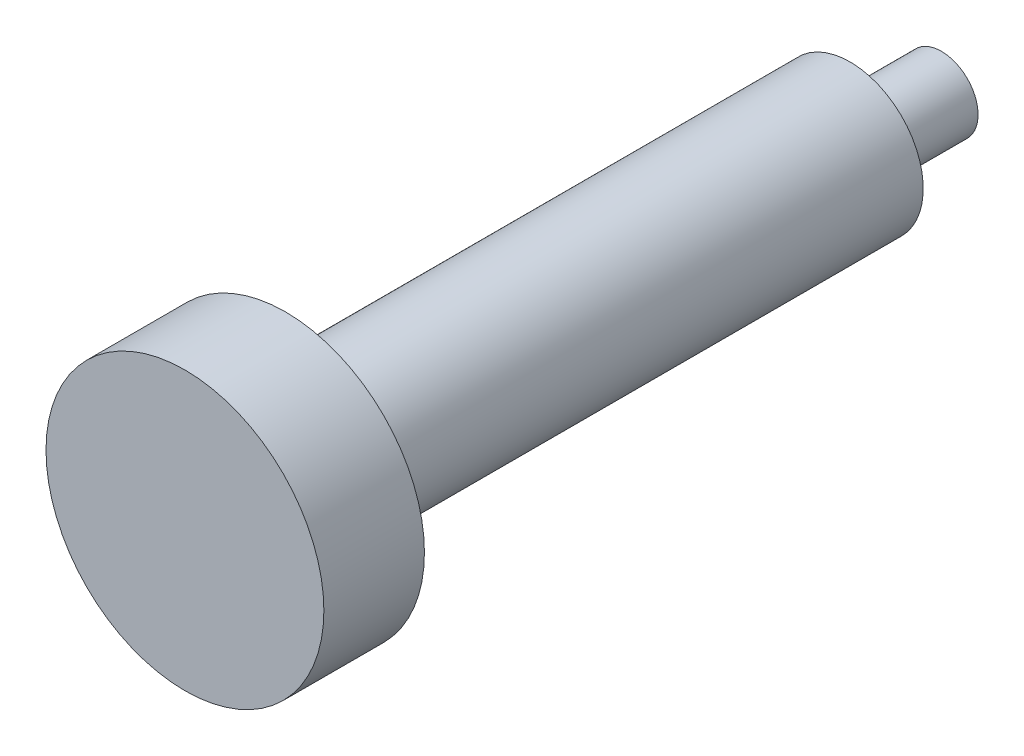
ISO-10303-21;
HEADER;
FILE_DESCRIPTION(('STEP AP214'),'2;1');
FILE_NAME('part.step','',(''),(''),'','','');
FILE_SCHEMA(('AUTOMOTIVE_DESIGN { 1 0 10303 214 1 1 1 1 }'));
ENDSEC;
DATA;
#1=APPLICATION_CONTEXT('core data for automotive mechanical design processes');
#2=APPLICATION_PROTOCOL_DEFINITION('international standard','automotive_design',2000,#1);
#3=PRODUCT_CONTEXT('',#1,'mechanical');
#4=PRODUCT('Part','Part','',(#3));
#5=PRODUCT_RELATED_PRODUCT_CATEGORY('part','',(#4));
#6=PRODUCT_DEFINITION_FORMATION('','',#4);
#7=PRODUCT_DEFINITION_CONTEXT('part definition',#1,'design');
#8=PRODUCT_DEFINITION('design','',#6,#7);
#9=PRODUCT_DEFINITION_SHAPE('','',#8);
#10=(LENGTH_UNIT() NAMED_UNIT(*) SI_UNIT(.MILLI.,.METRE.));
#11=(NAMED_UNIT(*) PLANE_ANGLE_UNIT() SI_UNIT($,.RADIAN.));
#12=(NAMED_UNIT(*) SI_UNIT($,.STERADIAN.) SOLID_ANGLE_UNIT());
#13=UNCERTAINTY_MEASURE_WITH_UNIT(LENGTH_MEASURE(1.E-05),#10,'distance_accuracy_value','');
#14=(GEOMETRIC_REPRESENTATION_CONTEXT(3) GLOBAL_UNCERTAINTY_ASSIGNED_CONTEXT((#13)) GLOBAL_UNIT_ASSIGNED_CONTEXT((#10,
#11,#12)) REPRESENTATION_CONTEXT('',''));
#15=CARTESIAN_POINT('',(0.,0.,0.));
#16=DIRECTION('',(0.,0.,1.));
#17=DIRECTION('',(1.,0.,0.));
#18=AXIS2_PLACEMENT_3D('',#15,#16,#17);
#19=CARTESIAN_POINT('',(0.,0.,-20.));
#20=DIRECTION('',(0.,0.,1.));
#21=DIRECTION('',(1.,0.,0.));
#22=AXIS2_PLACEMENT_3D('',#19,#20,#21);
#23=PLANE('',#22);
#24=CARTESIAN_POINT('',(0.,0.,-20.));
#25=DIRECTION('',(0.,0.,-1.));
#26=DIRECTION('',(-1.,0.,0.));
#27=AXIS2_PLACEMENT_3D('',#24,#25,#26);
#28=CIRCLE('',#27,8.);
#29=CARTESIAN_POINT('',(-8.,0.,-20.));
#30=VERTEX_POINT('',#29);
#31=EDGE_CURVE('E10',#30,#30,#28,.T.);
#32=ORIENTED_EDGE('',*,*,#31,.T.);
#33=EDGE_LOOP('',(#32));
#34=FACE_BOUND('',#33,.T.);
#35=ADVANCED_FACE('F37',(#34),#23,.F.);
#36=CARTESIAN_POINT('',(0.,0.,-20.));
#37=DIRECTION('',(0.,0.,-1.));
#38=DIRECTION('',(-1.,0.,0.));
#39=AXIS2_PLACEMENT_3D('',#36,#37,#38);
#40=CYLINDRICAL_SURFACE('',#39,8.);
#41=ORIENTED_EDGE('',*,*,#31,.F.);
#42=EDGE_LOOP('',(#41));
#43=FACE_BOUND('',#42,.T.);
#44=CARTESIAN_POINT('',(0.,0.,0.));
#45=DIRECTION('',(0.,0.,-1.));
#46=DIRECTION('',(-1.,0.,0.));
#47=AXIS2_PLACEMENT_3D('',#44,#45,#46);
#48=CIRCLE('',#47,8.);
#49=CARTESIAN_POINT('',(-8.,0.,0.));
#50=VERTEX_POINT('',#49);
#51=EDGE_CURVE('E43',#50,#50,#48,.T.);
#52=ORIENTED_EDGE('',*,*,#51,.T.);
#53=EDGE_LOOP('',(#52));
#54=FACE_BOUND('',#53,.T.);
#55=ADVANCED_FACE('F75',(#43,#54),#40,.T.);
#56=CARTESIAN_POINT('',(8.,0.,0.));
#57=DIRECTION('',(0.,0.,1.));
#58=DIRECTION('',(1.,0.,0.));
#59=AXIS2_PLACEMENT_3D('',#56,#57,#58);
#60=PLANE('',#59);
#61=ORIENTED_EDGE('',*,*,#51,.F.);
#62=EDGE_LOOP('',(#61));
#63=FACE_BOUND('',#62,.T.);
#64=CARTESIAN_POINT('',(0.,0.,0.));
#65=DIRECTION('',(0.,0.,-1.));
#66=DIRECTION('',(-1.,0.,0.));
#67=AXIS2_PLACEMENT_3D('',#64,#65,#66);
#68=CIRCLE('',#67,16.);
#69=CARTESIAN_POINT('',(-16.,0.,0.));
#70=VERTEX_POINT('',#69);
#71=EDGE_CURVE('E47',#70,#70,#68,.T.);
#72=ORIENTED_EDGE('',*,*,#71,.T.);
#73=EDGE_LOOP('',(#72));
#74=FACE_BOUND('',#73,.T.);
#75=ADVANCED_FACE('F79',(#63,#74),#60,.F.);
#76=CARTESIAN_POINT('',(0.,0.,-20.));
#77=DIRECTION('',(0.,0.,-1.));
#78=DIRECTION('',(-1.,0.,0.));
#79=AXIS2_PLACEMENT_3D('',#76,#77,#78);
#80=CYLINDRICAL_SURFACE('',#79,16.);
#81=ORIENTED_EDGE('',*,*,#71,.F.);
#82=EDGE_LOOP('',(#81));
#83=FACE_BOUND('',#82,.T.);
#84=CARTESIAN_POINT('',(0.,0.,123.535));
#85=DIRECTION('',(0.,0.,-1.));
#86=DIRECTION('',(-1.,0.,0.));
#87=AXIS2_PLACEMENT_3D('',#84,#85,#86);
#88=CIRCLE('',#87,16.);
#89=CARTESIAN_POINT('',(-16.,0.,123.535));
#90=VERTEX_POINT('',#89);
#91=EDGE_CURVE('E51',#90,#90,#88,.T.);
#92=ORIENTED_EDGE('',*,*,#91,.T.);
#93=EDGE_LOOP('',(#92));
#94=FACE_BOUND('',#93,.T.);
#95=ADVANCED_FACE('F84',(#83,#94),#80,.T.);
#96=CARTESIAN_POINT('',(16.,0.,123.535));
#97=DIRECTION('',(0.,0.,1.));
#98=DIRECTION('',(1.,0.,0.));
#99=AXIS2_PLACEMENT_3D('',#96,#97,#98);
#100=PLANE('',#99);
#101=ORIENTED_EDGE('',*,*,#91,.F.);
#102=EDGE_LOOP('',(#101));
#103=FACE_BOUND('',#102,.T.);
#104=CARTESIAN_POINT('',(0.,0.,123.535));
#105=DIRECTION('',(0.,0.,-1.));
#106=DIRECTION('',(-1.,0.,0.));
#107=AXIS2_PLACEMENT_3D('',#104,#105,#106);
#108=CIRCLE('',#107,30.4);
#109=CARTESIAN_POINT('',(-30.4,0.,123.535));
#110=VERTEX_POINT('',#109);
#111=EDGE_CURVE('E56',#110,#110,#108,.T.);
#112=ORIENTED_EDGE('',*,*,#111,.T.);
#113=EDGE_LOOP('',(#112));
#114=FACE_BOUND('',#113,.T.);
#115=ADVANCED_FACE('F71',(#103,#114),#100,.F.);
#116=CARTESIAN_POINT('',(0.,0.,-20.));
#117=DIRECTION('',(0.,0.,-1.));
#118=DIRECTION('',(-1.,0.,0.));
#119=AXIS2_PLACEMENT_3D('',#116,#117,#118);
#120=CYLINDRICAL_SURFACE('',#119,30.4);
#121=ORIENTED_EDGE('',*,*,#111,.F.);
#122=EDGE_LOOP('',(#121));
#123=FACE_BOUND('',#122,.T.);
#124=CARTESIAN_POINT('',(0.,0.,145.535));
#125=DIRECTION('',(0.,0.,-1.));
#126=DIRECTION('',(-1.,0.,0.));
#127=AXIS2_PLACEMENT_3D('',#124,#125,#126);
#128=CIRCLE('',#127,30.4);
#129=CARTESIAN_POINT('',(-30.4,0.,145.535));
#130=VERTEX_POINT('',#129);
#131=EDGE_CURVE('E59',#130,#130,#128,.T.);
#132=ORIENTED_EDGE('',*,*,#131,.T.);
#133=EDGE_LOOP('',(#132));
#134=FACE_BOUND('',#133,.T.);
#135=ADVANCED_FACE('F63',(#123,#134),#120,.T.);
#136=CARTESIAN_POINT('',(30.4,0.,145.535));
#137=DIRECTION('',(0.,0.,-1.));
#138=DIRECTION('',(-1.,0.,0.));
#139=AXIS2_PLACEMENT_3D('',#136,#137,#138);
#140=PLANE('',#139);
#141=ORIENTED_EDGE('',*,*,#131,.F.);
#142=EDGE_LOOP('',(#141));
#143=FACE_BOUND('',#142,.T.);
#144=ADVANCED_FACE('F65',(#143),#140,.F.);
#145=CLOSED_SHELL('',(#35,#55,#75,#95,#115,#135,#144));
#146=MANIFOLD_SOLID_BREP('B2',#145);
#147=ADVANCED_BREP_SHAPE_REPRESENTATION('',(#18,#146),#14);
#148=SHAPE_DEFINITION_REPRESENTATION(#9,#147);
ENDSEC;
END-ISO-10303-21;
